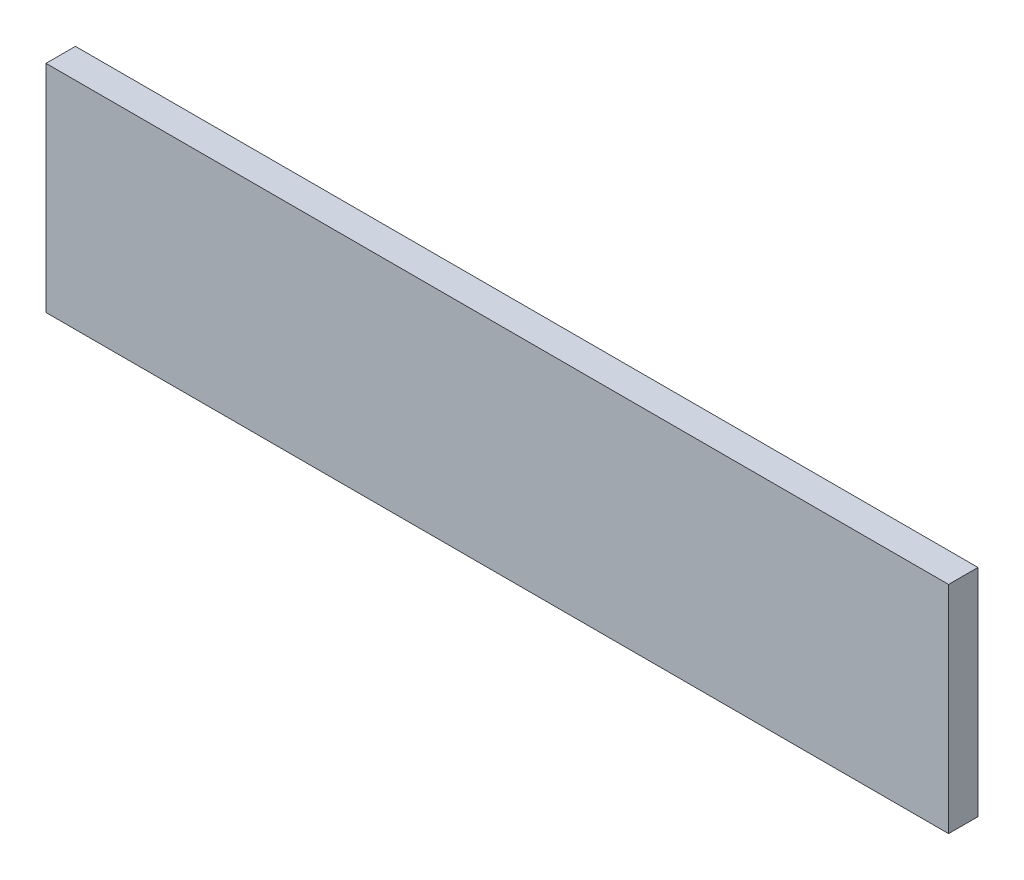
ISO-10303-21;
HEADER;
FILE_DESCRIPTION(('STEP AP214'),'2;1');
FILE_NAME('part.step','',(''),(''),'','','');
FILE_SCHEMA(('AUTOMOTIVE_DESIGN { 1 0 10303 214 1 1 1 1 }'));
ENDSEC;
DATA;
#1=APPLICATION_CONTEXT('core data for automotive mechanical design processes');
#2=APPLICATION_PROTOCOL_DEFINITION('international standard','automotive_design',2000,#1);
#3=PRODUCT_CONTEXT('',#1,'mechanical');
#4=PRODUCT('Part','Part','',(#3));
#5=PRODUCT_RELATED_PRODUCT_CATEGORY('part','',(#4));
#6=PRODUCT_DEFINITION_FORMATION('','',#4);
#7=PRODUCT_DEFINITION_CONTEXT('part definition',#1,'design');
#8=PRODUCT_DEFINITION('design','',#6,#7);
#9=PRODUCT_DEFINITION_SHAPE('','',#8);
#10=(LENGTH_UNIT() NAMED_UNIT(*) SI_UNIT(.MILLI.,.METRE.));
#11=(NAMED_UNIT(*) PLANE_ANGLE_UNIT() SI_UNIT($,.RADIAN.));
#12=(NAMED_UNIT(*) SI_UNIT($,.STERADIAN.) SOLID_ANGLE_UNIT());
#13=UNCERTAINTY_MEASURE_WITH_UNIT(LENGTH_MEASURE(1.E-05),#10,'distance_accuracy_value','');
#14=(GEOMETRIC_REPRESENTATION_CONTEXT(3) GLOBAL_UNCERTAINTY_ASSIGNED_CONTEXT((#13)) GLOBAL_UNIT_ASSIGNED_CONTEXT((#10,
#11,#12)) REPRESENTATION_CONTEXT('',''));
#15=CARTESIAN_POINT('',(0.,0.,0.));
#16=DIRECTION('',(0.,0.,1.));
#17=DIRECTION('',(1.,0.,0.));
#18=AXIS2_PLACEMENT_3D('',#15,#16,#17);
#19=CARTESIAN_POINT('',(0.,0.,-19.05));
#20=DIRECTION('',(0.,0.,-1.));
#21=DIRECTION('',(-1.,0.,0.));
#22=AXIS2_PLACEMENT_3D('',#19,#20,#21);
#23=PLANE('',#22);
#24=DIRECTION('',(1.,0.,0.));
#25=VECTOR('',#24,1.);
#26=CARTESIAN_POINT('',(0.,0.,-19.05));
#27=LINE('',#26,#25);
#28=CARTESIAN_POINT('',(0.,0.,-19.05));
#29=VERTEX_POINT('',#28);
#30=CARTESIAN_POINT('',(584.2,0.,-19.05));
#31=VERTEX_POINT('',#30);
#32=EDGE_CURVE('E19',#29,#31,#27,.T.);
#33=ORIENTED_EDGE('',*,*,#32,.F.);
#34=DIRECTION('',(0.,1.,0.));
#35=VECTOR('',#34,1.);
#36=CARTESIAN_POINT('',(0.,0.,-19.05));
#37=LINE('',#36,#35);
#38=CARTESIAN_POINT('',(0.,139.7,-19.05));
#39=VERTEX_POINT('',#38);
#40=EDGE_CURVE('E79',#29,#39,#37,.T.);
#41=ORIENTED_EDGE('',*,*,#40,.T.);
#42=DIRECTION('',(1.,0.,0.));
#43=VECTOR('',#42,1.);
#44=CARTESIAN_POINT('',(0.,139.7,-19.05));
#45=LINE('',#44,#43);
#46=CARTESIAN_POINT('',(584.2,139.7,-19.05));
#47=VERTEX_POINT('',#46);
#48=EDGE_CURVE('E60',#47,#39,#45,.F.);
#49=ORIENTED_EDGE('',*,*,#48,.F.);
#50=DIRECTION('',(0.,1.,0.));
#51=VECTOR('',#50,1.);
#52=CARTESIAN_POINT('',(584.2,0.,-19.05));
#53=LINE('',#52,#51);
#54=EDGE_CURVE('E55',#31,#47,#53,.T.);
#55=ORIENTED_EDGE('',*,*,#54,.F.);
#56=EDGE_LOOP('',(#33,#41,#49,#55));
#57=FACE_BOUND('',#56,.T.);
#58=ADVANCED_FACE('F16',(#57),#23,.T.);
#59=CARTESIAN_POINT('',(0.,0.,0.));
#60=DIRECTION('',(0.,-1.,0.));
#61=DIRECTION('',(0.,0.,-1.));
#62=AXIS2_PLACEMENT_3D('',#59,#60,#61);
#63=PLANE('',#62);
#64=DIRECTION('',(1.,0.,0.));
#65=VECTOR('',#64,1.);
#66=CARTESIAN_POINT('',(0.,0.,0.));
#67=LINE('',#66,#65);
#68=CARTESIAN_POINT('',(0.,0.,0.));
#69=VERTEX_POINT('',#68);
#70=CARTESIAN_POINT('',(584.2,0.,0.));
#71=VERTEX_POINT('',#70);
#72=EDGE_CURVE('E82',#69,#71,#67,.T.);
#73=ORIENTED_EDGE('',*,*,#72,.F.);
#74=DIRECTION('',(0.,0.,-1.));
#75=VECTOR('',#74,1.);
#76=CARTESIAN_POINT('',(0.,0.,0.));
#77=LINE('',#76,#75);
#78=EDGE_CURVE('E67',#69,#29,#77,.T.);
#79=ORIENTED_EDGE('',*,*,#78,.T.);
#80=ORIENTED_EDGE('',*,*,#32,.T.);
#81=DIRECTION('',(0.,0.,-1.));
#82=VECTOR('',#81,1.);
#83=CARTESIAN_POINT('',(584.2,0.,0.));
#84=LINE('',#83,#82);
#85=EDGE_CURVE('E62',#71,#31,#84,.T.);
#86=ORIENTED_EDGE('',*,*,#85,.F.);
#87=EDGE_LOOP('',(#73,#79,#80,#86));
#88=FACE_BOUND('',#87,.T.);
#89=ADVANCED_FACE('F64',(#88),#63,.T.);
#90=CARTESIAN_POINT('',(584.2,0.,0.));
#91=DIRECTION('',(1.,0.,0.));
#92=DIRECTION('',(0.,0.,-1.));
#93=AXIS2_PLACEMENT_3D('',#90,#91,#92);
#94=PLANE('',#93);
#95=DIRECTION('',(0.,1.,0.));
#96=VECTOR('',#95,1.);
#97=CARTESIAN_POINT('',(584.2,139.7,0.));
#98=LINE('',#97,#96);
#99=CARTESIAN_POINT('',(584.2,139.7,0.));
#100=VERTEX_POINT('',#99);
#101=EDGE_CURVE('E71',#71,#100,#98,.T.);
#102=ORIENTED_EDGE('',*,*,#101,.F.);
#103=ORIENTED_EDGE('',*,*,#85,.T.);
#104=ORIENTED_EDGE('',*,*,#54,.T.);
#105=DIRECTION('',(0.,0.,1.));
#106=VECTOR('',#105,1.);
#107=CARTESIAN_POINT('',(584.2,139.7,-19.05));
#108=LINE('',#107,#106);
#109=EDGE_CURVE('E73',#100,#47,#108,.F.);
#110=ORIENTED_EDGE('',*,*,#109,.F.);
#111=EDGE_LOOP('',(#102,#103,#104,#110));
#112=FACE_BOUND('',#111,.T.);
#113=ADVANCED_FACE('F69',(#112),#94,.T.);
#114=CARTESIAN_POINT('',(0.,139.7,-19.05));
#115=DIRECTION('',(0.,1.,0.));
#116=DIRECTION('',(0.,0.,1.));
#117=AXIS2_PLACEMENT_3D('',#114,#115,#116);
#118=PLANE('',#117);
#119=ORIENTED_EDGE('',*,*,#48,.T.);
#120=DIRECTION('',(0.,0.,-1.));
#121=VECTOR('',#120,1.);
#122=CARTESIAN_POINT('',(0.,139.7,0.));
#123=LINE('',#122,#121);
#124=CARTESIAN_POINT('',(0.,139.7,0.));
#125=VERTEX_POINT('',#124);
#126=EDGE_CURVE('E34',#39,#125,#123,.F.);
#127=ORIENTED_EDGE('',*,*,#126,.T.);
#128=DIRECTION('',(1.,0.,0.));
#129=VECTOR('',#128,1.);
#130=CARTESIAN_POINT('',(0.,139.7,0.));
#131=LINE('',#130,#129);
#132=EDGE_CURVE('E25',#100,#125,#131,.F.);
#133=ORIENTED_EDGE('',*,*,#132,.F.);
#134=ORIENTED_EDGE('',*,*,#109,.T.);
#135=EDGE_LOOP('',(#119,#127,#133,#134));
#136=FACE_BOUND('',#135,.T.);
#137=ADVANCED_FACE('F88',(#136),#118,.T.);
#138=CARTESIAN_POINT('',(0.,0.,0.));
#139=DIRECTION('',(1.,0.,0.));
#140=DIRECTION('',(0.,0.,-1.));
#141=AXIS2_PLACEMENT_3D('',#138,#139,#140);
#142=PLANE('',#141);
#143=ORIENTED_EDGE('',*,*,#126,.F.);
#144=ORIENTED_EDGE('',*,*,#40,.F.);
#145=ORIENTED_EDGE('',*,*,#78,.F.);
#146=DIRECTION('',(0.,1.,0.));
#147=VECTOR('',#146,1.);
#148=CARTESIAN_POINT('',(0.,139.7,0.));
#149=LINE('',#148,#147);
#150=EDGE_CURVE('E11',#125,#69,#149,.F.);
#151=ORIENTED_EDGE('',*,*,#150,.F.);
#152=EDGE_LOOP('',(#143,#144,#145,#151));
#153=FACE_BOUND('',#152,.T.);
#154=ADVANCED_FACE('F90',(#153),#142,.F.);
#155=CARTESIAN_POINT('',(0.,139.7,0.));
#156=DIRECTION('',(0.,0.,1.));
#157=DIRECTION('',(1.,0.,0.));
#158=AXIS2_PLACEMENT_3D('',#155,#156,#157);
#159=PLANE('',#158);
#160=ORIENTED_EDGE('',*,*,#132,.T.);
#161=ORIENTED_EDGE('',*,*,#150,.T.);
#162=ORIENTED_EDGE('',*,*,#72,.T.);
#163=ORIENTED_EDGE('',*,*,#101,.T.);
#164=EDGE_LOOP('',(#160,#161,#162,#163));
#165=FACE_BOUND('',#164,.T.);
#166=ADVANCED_FACE('F87',(#165),#159,.T.);
#167=CLOSED_SHELL('',(#58,#89,#113,#137,#154,#166));
#168=MANIFOLD_SOLID_BREP('B1',#167);
#169=ADVANCED_BREP_SHAPE_REPRESENTATION('',(#18,#168),#14);
#170=SHAPE_DEFINITION_REPRESENTATION(#9,#169);
ENDSEC;
END-ISO-10303-21;
